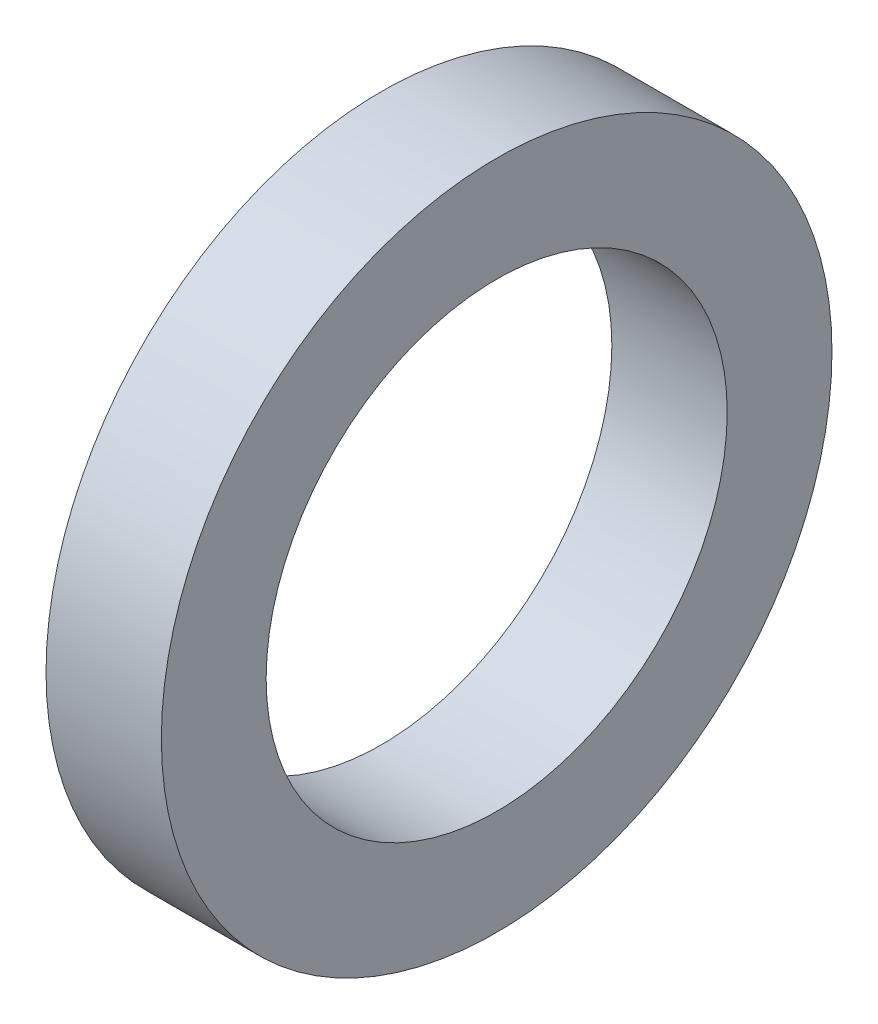
ISO-10303-21;
HEADER;
FILE_DESCRIPTION(('STEP AP214'),'2;1');
FILE_NAME('part.step','',(''),(''),'','','');
FILE_SCHEMA(('AUTOMOTIVE_DESIGN { 1 0 10303 214 1 1 1 1 }'));
ENDSEC;
DATA;
#1=APPLICATION_CONTEXT('core data for automotive mechanical design processes');
#2=APPLICATION_PROTOCOL_DEFINITION('international standard','automotive_design',2000,#1);
#3=PRODUCT_CONTEXT('',#1,'mechanical');
#4=PRODUCT('Part','Part','',(#3));
#5=PRODUCT_RELATED_PRODUCT_CATEGORY('part','',(#4));
#6=PRODUCT_DEFINITION_FORMATION('','',#4);
#7=PRODUCT_DEFINITION_CONTEXT('part definition',#1,'design');
#8=PRODUCT_DEFINITION('design','',#6,#7);
#9=PRODUCT_DEFINITION_SHAPE('','',#8);
#10=(LENGTH_UNIT() NAMED_UNIT(*) SI_UNIT(.MILLI.,.METRE.));
#11=(NAMED_UNIT(*) PLANE_ANGLE_UNIT() SI_UNIT($,.RADIAN.));
#12=(NAMED_UNIT(*) SI_UNIT($,.STERADIAN.) SOLID_ANGLE_UNIT());
#13=UNCERTAINTY_MEASURE_WITH_UNIT(LENGTH_MEASURE(1.E-05),#10,'distance_accuracy_value','');
#14=(GEOMETRIC_REPRESENTATION_CONTEXT(3) GLOBAL_UNCERTAINTY_ASSIGNED_CONTEXT((#13)) GLOBAL_UNIT_ASSIGNED_CONTEXT((#10,
#11,#12)) REPRESENTATION_CONTEXT('',''));
#15=CARTESIAN_POINT('',(0.,0.,0.));
#16=DIRECTION('',(0.,0.,1.));
#17=DIRECTION('',(1.,0.,0.));
#18=AXIS2_PLACEMENT_3D('',#15,#16,#17);
#19=CARTESIAN_POINT('',(8.7376,0.,0.));
#20=DIRECTION('',(-1.,0.,0.));
#21=DIRECTION('',(0.,0.,1.));
#22=AXIS2_PLACEMENT_3D('',#19,#20,#21);
#23=CYLINDRICAL_SURFACE('',#22,25.4);
#24=CARTESIAN_POINT('',(8.7376,0.,0.));
#25=DIRECTION('',(1.,0.,0.));
#26=DIRECTION('',(0.,0.,-1.));
#27=AXIS2_PLACEMENT_3D('',#24,#25,#26);
#28=CIRCLE('',#27,25.4);
#29=CARTESIAN_POINT('',(8.7376,0.,-25.4));
#30=VERTEX_POINT('',#29);
#31=EDGE_CURVE('E10',#30,#30,#28,.T.);
#32=ORIENTED_EDGE('',*,*,#31,.F.);
#33=EDGE_LOOP('',(#32));
#34=FACE_BOUND('',#33,.T.);
#35=CARTESIAN_POINT('',(0.,0.,0.));
#36=DIRECTION('',(1.,0.,0.));
#37=DIRECTION('',(0.,0.,-1.));
#38=AXIS2_PLACEMENT_3D('',#35,#36,#37);
#39=CIRCLE('',#38,25.4);
#40=CARTESIAN_POINT('',(0.,0.,-25.4));
#41=VERTEX_POINT('',#40);
#42=EDGE_CURVE('E46',#41,#41,#39,.T.);
#43=ORIENTED_EDGE('',*,*,#42,.T.);
#44=EDGE_LOOP('',(#43));
#45=FACE_BOUND('',#44,.T.);
#46=ADVANCED_FACE('F43',(#34,#45),#23,.T.);
#47=CARTESIAN_POINT('',(8.7376,0.,0.));
#48=DIRECTION('',(1.,0.,0.));
#49=DIRECTION('',(0.,0.,-1.));
#50=AXIS2_PLACEMENT_3D('',#47,#48,#49);
#51=PLANE('',#50);
#52=CARTESIAN_POINT('',(8.7376,0.,0.));
#53=DIRECTION('',(1.,0.,0.));
#54=DIRECTION('',(0.,0.,-1.));
#55=AXIS2_PLACEMENT_3D('',#52,#53,#54);
#56=CIRCLE('',#55,17.4625);
#57=CARTESIAN_POINT('',(8.7376,0.,-17.4625));
#58=VERTEX_POINT('',#57);
#59=EDGE_CURVE('E60',#58,#58,#56,.T.);
#60=ORIENTED_EDGE('',*,*,#59,.F.);
#61=EDGE_LOOP('',(#60));
#62=FACE_BOUND('',#61,.T.);
#63=ORIENTED_EDGE('',*,*,#31,.T.);
#64=EDGE_LOOP('',(#63));
#65=FACE_BOUND('',#64,.T.);
#66=ADVANCED_FACE('F67',(#62,#65),#51,.T.);
#67=CARTESIAN_POINT('',(0.,0.,0.));
#68=DIRECTION('',(1.,0.,0.));
#69=DIRECTION('',(0.,0.,-1.));
#70=AXIS2_PLACEMENT_3D('',#67,#68,#69);
#71=PLANE('',#70);
#72=CARTESIAN_POINT('',(0.,0.,0.));
#73=DIRECTION('',(1.,0.,0.));
#74=DIRECTION('',(0.,0.,-1.));
#75=AXIS2_PLACEMENT_3D('',#72,#73,#74);
#76=CIRCLE('',#75,17.4625);
#77=CARTESIAN_POINT('',(0.,0.,-17.4625));
#78=VERTEX_POINT('',#77);
#79=EDGE_CURVE('E55',#78,#78,#76,.T.);
#80=ORIENTED_EDGE('',*,*,#79,.T.);
#81=EDGE_LOOP('',(#80));
#82=FACE_BOUND('',#81,.T.);
#83=ORIENTED_EDGE('',*,*,#42,.F.);
#84=EDGE_LOOP('',(#83));
#85=FACE_BOUND('',#84,.T.);
#86=ADVANCED_FACE('F69',(#82,#85),#71,.F.);
#87=CARTESIAN_POINT('',(8.7376,0.,0.));
#88=DIRECTION('',(1.,0.,0.));
#89=DIRECTION('',(0.,0.,-1.));
#90=AXIS2_PLACEMENT_3D('',#87,#88,#89);
#91=CYLINDRICAL_SURFACE('',#90,17.4625);
#92=ORIENTED_EDGE('',*,*,#79,.F.);
#93=EDGE_LOOP('',(#92));
#94=FACE_BOUND('',#93,.T.);
#95=ORIENTED_EDGE('',*,*,#59,.T.);
#96=EDGE_LOOP('',(#95));
#97=FACE_BOUND('',#96,.T.);
#98=ADVANCED_FACE('F65',(#94,#97),#91,.F.);
#99=CLOSED_SHELL('',(#46,#66,#86,#98));
#100=MANIFOLD_SOLID_BREP('B2',#99);
#101=ADVANCED_BREP_SHAPE_REPRESENTATION('',(#18,#100),#14);
#102=SHAPE_DEFINITION_REPRESENTATION(#9,#101);
ENDSEC;
END-ISO-10303-21;
